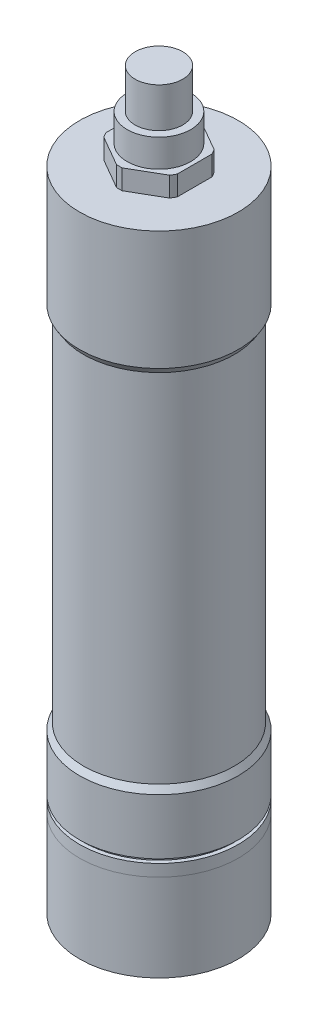
ISO-10303-21;
HEADER;
FILE_DESCRIPTION(('STEP AP214'),'2;1');
FILE_NAME('part.step','',(''),(''),'','','');
FILE_SCHEMA(('AUTOMOTIVE_DESIGN { 1 0 10303 214 1 1 1 1 }'));
ENDSEC;
DATA;
#1=APPLICATION_CONTEXT('core data for automotive mechanical design processes');
#2=APPLICATION_PROTOCOL_DEFINITION('international standard','automotive_design',2000,#1);
#3=PRODUCT_CONTEXT('',#1,'mechanical');
#4=PRODUCT('Part','Part','',(#3));
#5=PRODUCT_RELATED_PRODUCT_CATEGORY('part','',(#4));
#6=PRODUCT_DEFINITION_FORMATION('','',#4);
#7=PRODUCT_DEFINITION_CONTEXT('part definition',#1,'design');
#8=PRODUCT_DEFINITION('design','',#6,#7);
#9=PRODUCT_DEFINITION_SHAPE('','',#8);
#10=(LENGTH_UNIT() NAMED_UNIT(*) SI_UNIT(.MILLI.,.METRE.));
#11=(NAMED_UNIT(*) PLANE_ANGLE_UNIT() SI_UNIT($,.RADIAN.));
#12=(NAMED_UNIT(*) SI_UNIT($,.STERADIAN.) SOLID_ANGLE_UNIT());
#13=UNCERTAINTY_MEASURE_WITH_UNIT(LENGTH_MEASURE(1.E-05),#10,'distance_accuracy_value','');
#14=(GEOMETRIC_REPRESENTATION_CONTEXT(3) GLOBAL_UNCERTAINTY_ASSIGNED_CONTEXT((#13)) GLOBAL_UNIT_ASSIGNED_CONTEXT((#10,
#11,#12)) REPRESENTATION_CONTEXT('',''));
#15=CARTESIAN_POINT('',(0.,0.,0.));
#16=DIRECTION('',(0.,0.,1.));
#17=DIRECTION('',(1.,0.,0.));
#18=AXIS2_PLACEMENT_3D('',#15,#16,#17);
#19=CARTESIAN_POINT('',(-20.24,22.,20.24));
#20=DIRECTION('',(0.,-1.,0.));
#21=DIRECTION('',(0.,0.,-1.));
#22=AXIS2_PLACEMENT_3D('',#19,#20,#21);
#23=PLANE('',#22);
#24=CARTESIAN_POINT('',(0.,22.,0.));
#25=DIRECTION('',(0.,1.,0.));
#26=DIRECTION('',(0.,0.,1.));
#27=AXIS2_PLACEMENT_3D('',#24,#25,#26);
#28=CIRCLE('',#27,20.);
#29=CARTESIAN_POINT('',(0.,22.,20.));
#30=VERTEX_POINT('',#29);
#31=EDGE_CURVE('P0_E20',#30,#30,#28,.F.);
#32=ORIENTED_EDGE('',*,*,#31,.T.);
#33=EDGE_LOOP('',(#32));
#34=FACE_BOUND('',#33,.T.);
#35=ADVANCED_FACE('P0_F16',(#34),#23,.T.);
#36=CARTESIAN_POINT('',(0.,22.,0.));
#37=DIRECTION('',(0.,1.,0.));
#38=DIRECTION('',(0.,0.,1.));
#39=AXIS2_PLACEMENT_3D('',#36,#37,#38);
#40=CYLINDRICAL_SURFACE('',#39,20.);
#41=CARTESIAN_POINT('',(0.,25.,0.));
#42=DIRECTION('',(0.,1.,0.));
#43=DIRECTION('',(0.,0.,1.));
#44=AXIS2_PLACEMENT_3D('',#41,#42,#43);
#45=CIRCLE('',#44,20.);
#46=CARTESIAN_POINT('',(0.,25.,20.));
#47=VERTEX_POINT('',#46);
#48=EDGE_CURVE('P0_E249',#47,#47,#45,.F.);
#49=ORIENTED_EDGE('',*,*,#48,.T.);
#50=EDGE_LOOP('',(#49));
#51=FACE_BOUND('',#50,.T.);
#52=ORIENTED_EDGE('',*,*,#31,.F.);
#53=EDGE_LOOP('',(#52));
#54=FACE_BOUND('',#53,.T.);
#55=ADVANCED_FACE('P0_F260',(#51,#54),#40,.T.);
#56=CARTESIAN_POINT('',(-20.24,25.,-20.24));
#57=DIRECTION('',(0.,-1.,0.));
#58=DIRECTION('',(1.,0.,0.));
#59=AXIS2_PLACEMENT_3D('',#56,#57,#58);
#60=PLANE('',#59);
#61=CARTESIAN_POINT('',(0.,25.,0.));
#62=DIRECTION('',(0.,-1.,0.));
#63=DIRECTION('',(0.,0.,-1.));
#64=AXIS2_PLACEMENT_3D('',#61,#62,#63);
#65=CIRCLE('',#64,19.);
#66=CARTESIAN_POINT('',(0.,25.,-19.));
#67=VERTEX_POINT('',#66);
#68=EDGE_CURVE('P0_E246',#67,#67,#65,.T.);
#69=ORIENTED_EDGE('',*,*,#68,.T.);
#70=EDGE_LOOP('',(#69));
#71=FACE_BOUND('',#70,.T.);
#72=ORIENTED_EDGE('',*,*,#48,.F.);
#73=EDGE_LOOP('',(#72));
#74=FACE_BOUND('',#73,.T.);
#75=ADVANCED_FACE('P0_F262',(#71,#74),#60,.F.);
#76=CARTESIAN_POINT('',(0.,26.,0.));
#77=DIRECTION('',(0.,-1.,0.));
#78=DIRECTION('',(0.,0.,-1.));
#79=AXIS2_PLACEMENT_3D('',#76,#77,#78);
#80=CYLINDRICAL_SURFACE('',#79,19.);
#81=CARTESIAN_POINT('',(0.,26.,0.));
#82=DIRECTION('',(0.,-1.,0.));
#83=DIRECTION('',(0.,0.,-1.));
#84=AXIS2_PLACEMENT_3D('',#81,#82,#83);
#85=CIRCLE('',#84,19.);
#86=CARTESIAN_POINT('',(0.,26.,-19.));
#87=VERTEX_POINT('',#86);
#88=EDGE_CURVE('P0_E243',#87,#87,#85,.F.);
#89=ORIENTED_EDGE('',*,*,#88,.F.);
#90=EDGE_LOOP('',(#89));
#91=FACE_BOUND('',#90,.T.);
#92=ORIENTED_EDGE('',*,*,#68,.F.);
#93=EDGE_LOOP('',(#92));
#94=FACE_BOUND('',#93,.T.);
#95=ADVANCED_FACE('P0_F269',(#91,#94),#80,.T.);
#96=CARTESIAN_POINT('',(-20.24,26.,-20.24));
#97=DIRECTION('',(0.,-1.,0.));
#98=DIRECTION('',(1.,0.,0.));
#99=AXIS2_PLACEMENT_3D('',#96,#97,#98);
#100=PLANE('',#99);
#101=ORIENTED_EDGE('',*,*,#88,.T.);
#102=EDGE_LOOP('',(#101));
#103=FACE_BOUND('',#102,.T.);
#104=CARTESIAN_POINT('',(0.,26.,0.));
#105=DIRECTION('',(0.,1.,0.));
#106=DIRECTION('',(0.,0.,1.));
#107=AXIS2_PLACEMENT_3D('',#104,#105,#106);
#108=CIRCLE('',#107,20.);
#109=CARTESIAN_POINT('',(0.,26.,20.));
#110=VERTEX_POINT('',#109);
#111=EDGE_CURVE('P0_E187',#110,#110,#108,.F.);
#112=ORIENTED_EDGE('',*,*,#111,.T.);
#113=EDGE_LOOP('',(#112));
#114=FACE_BOUND('',#113,.T.);
#115=ADVANCED_FACE('P0_F326',(#103,#114),#100,.T.);
#116=CARTESIAN_POINT('',(0.,26.,0.));
#117=DIRECTION('',(0.,1.,0.));
#118=DIRECTION('',(0.,0.,1.));
#119=AXIS2_PLACEMENT_3D('',#116,#117,#118);
#120=CYLINDRICAL_SURFACE('',#119,20.);
#121=ORIENTED_EDGE('',*,*,#111,.F.);
#122=EDGE_LOOP('',(#121));
#123=FACE_BOUND('',#122,.T.);
#124=CARTESIAN_POINT('',(0.,40.,0.));
#125=DIRECTION('',(0.,-1.,0.));
#126=DIRECTION('',(1.,0.,0.));
#127=AXIS2_PLACEMENT_3D('',#124,#125,#126);
#128=CIRCLE('',#127,20.);
#129=CARTESIAN_POINT('',(20.,40.,0.));
#130=VERTEX_POINT('',#129);
#131=EDGE_CURVE('P0_E184',#130,#130,#128,.T.);
#132=ORIENTED_EDGE('',*,*,#131,.T.);
#133=EDGE_LOOP('',(#132));
#134=FACE_BOUND('',#133,.T.);
#135=ADVANCED_FACE('P0_F323',(#123,#134),#120,.T.);
#136=CARTESIAN_POINT('',(0.,41.6,0.));
#137=DIRECTION('',(0.,-1.,0.));
#138=DIRECTION('',(0.,0.,-1.));
#139=AXIS2_PLACEMENT_3D('',#136,#137,#138);
#140=CONICAL_SURFACE('',#139,19.,0.558599315343562);
#141=CARTESIAN_POINT('',(0.,41.6,0.));
#142=DIRECTION('',(0.,1.,0.));
#143=DIRECTION('',(-1.,0.,0.));
#144=AXIS2_PLACEMENT_3D('',#141,#142,#143);
#145=CIRCLE('',#144,19.);
#146=CARTESIAN_POINT('',(-19.,41.6,0.));
#147=VERTEX_POINT('',#146);
#148=EDGE_CURVE('P0_E180',#147,#147,#145,.F.);
#149=ORIENTED_EDGE('',*,*,#148,.T.);
#150=EDGE_LOOP('',(#149));
#151=FACE_BOUND('',#150,.T.);
#152=ORIENTED_EDGE('',*,*,#131,.F.);
#153=EDGE_LOOP('',(#152));
#154=FACE_BOUND('',#153,.T.);
#155=ADVANCED_FACE('P0_F319',(#151,#154),#140,.T.);
#156=CARTESIAN_POINT('',(0.,41.6,0.));
#157=DIRECTION('',(0.,1.,0.));
#158=DIRECTION('',(0.,0.,1.));
#159=AXIS2_PLACEMENT_3D('',#156,#157,#158);
#160=CYLINDRICAL_SURFACE('',#159,19.);
#161=ORIENTED_EDGE('',*,*,#148,.F.);
#162=EDGE_LOOP('',(#161));
#163=FACE_BOUND('',#162,.T.);
#164=CARTESIAN_POINT('',(0.,131.4,0.));
#165=DIRECTION('',(0.,1.,0.));
#166=DIRECTION('',(-1.,0.,0.));
#167=AXIS2_PLACEMENT_3D('',#164,#165,#166);
#168=CIRCLE('',#167,19.);
#169=CARTESIAN_POINT('',(-19.,131.4,0.));
#170=VERTEX_POINT('',#169);
#171=EDGE_CURVE('P0_E176',#170,#170,#168,.F.);
#172=ORIENTED_EDGE('',*,*,#171,.T.);
#173=EDGE_LOOP('',(#172));
#174=FACE_BOUND('',#173,.T.);
#175=ADVANCED_FACE('P0_F315',(#163,#174),#160,.T.);
#176=CARTESIAN_POINT('',(0.,131.4,0.));
#177=DIRECTION('',(0.,1.,0.));
#178=DIRECTION('',(0.,0.,1.));
#179=AXIS2_PLACEMENT_3D('',#176,#177,#178);
#180=CONICAL_SURFACE('',#179,19.,0.558599315343566);
#181=ORIENTED_EDGE('',*,*,#171,.F.);
#182=EDGE_LOOP('',(#181));
#183=FACE_BOUND('',#182,.T.);
#184=CARTESIAN_POINT('',(0.,133.,0.));
#185=DIRECTION('',(0.,1.,0.));
#186=DIRECTION('',(-1.,0.,0.));
#187=AXIS2_PLACEMENT_3D('',#184,#185,#186);
#188=CIRCLE('',#187,20.);
#189=CARTESIAN_POINT('',(-20.,133.,0.));
#190=VERTEX_POINT('',#189);
#191=EDGE_CURVE('P0_E172',#190,#190,#188,.F.);
#192=ORIENTED_EDGE('',*,*,#191,.T.);
#193=EDGE_LOOP('',(#192));
#194=FACE_BOUND('',#193,.T.);
#195=ADVANCED_FACE('P0_F311',(#183,#194),#180,.T.);
#196=CARTESIAN_POINT('',(0.,133.,0.));
#197=DIRECTION('',(0.,1.,0.));
#198=DIRECTION('',(0.,0.,1.));
#199=AXIS2_PLACEMENT_3D('',#196,#197,#198);
#200=CYLINDRICAL_SURFACE('',#199,20.);
#201=ORIENTED_EDGE('',*,*,#191,.F.);
#202=EDGE_LOOP('',(#201));
#203=FACE_BOUND('',#202,.T.);
#204=CARTESIAN_POINT('',(0.,163.,0.));
#205=DIRECTION('',(0.,1.,0.));
#206=DIRECTION('',(0.,0.,1.));
#207=AXIS2_PLACEMENT_3D('',#204,#205,#206);
#208=CIRCLE('',#207,20.);
#209=CARTESIAN_POINT('',(0.,163.,20.));
#210=VERTEX_POINT('',#209);
#211=EDGE_CURVE('P0_E125',#210,#210,#208,.T.);
#212=ORIENTED_EDGE('',*,*,#211,.F.);
#213=EDGE_LOOP('',(#212));
#214=FACE_BOUND('',#213,.T.);
#215=ADVANCED_FACE('P0_F308',(#203,#214),#200,.T.);
#216=CARTESIAN_POINT('',(0.,163.,0.));
#217=DIRECTION('',(0.,1.,0.));
#218=DIRECTION('',(0.,0.,1.));
#219=AXIS2_PLACEMENT_3D('',#216,#217,#218);
#220=CYLINDRICAL_SURFACE('',#219,10.);
#221=DIRECTION('',(0.,1.,0.));
#222=VECTOR('',#221,1.);
#223=CARTESIAN_POINT('',(-8.274917218,165.5,-5.614779162));
#224=LINE('',#223,#222);
#225=CARTESIAN_POINT('',(-8.27491721786181,163.,-5.61477916207979));
#226=VERTEX_POINT('',#225);
#227=CARTESIAN_POINT('',(-8.27491721517859,168.,-5.61477916603424));
#228=VERTEX_POINT('',#227);
#229=EDGE_CURVE('P0_E170',#226,#228,#224,.T.);
#230=ORIENTED_EDGE('',*,*,#229,.F.);
#231=CARTESIAN_POINT('',(0.,163.,0.));
#232=DIRECTION('',(0.,1.,0.));
#233=DIRECTION('',(0.,0.,1.));
#234=AXIS2_PLACEMENT_3D('',#231,#232,#233);
#235=CIRCLE('',#234,10.);
#236=CARTESIAN_POINT('',(-9.,163.,-4.35889894377034));
#237=VERTEX_POINT('',#236);
#238=EDGE_CURVE('P0_E213',#237,#226,#235,.F.);
#239=ORIENTED_EDGE('',*,*,#238,.F.);
#240=DIRECTION('',(0.,-1.,0.));
#241=VECTOR('',#240,1.);
#242=CARTESIAN_POINT('',(-9.,165.5,-4.358898944));
#243=LINE('',#242,#241);
#244=CARTESIAN_POINT('',(-9.,168.,-4.35889894377033));
#245=VERTEX_POINT('',#244);
#246=EDGE_CURVE('P0_E165',#245,#237,#243,.T.);
#247=ORIENTED_EDGE('',*,*,#246,.F.);
#248=CARTESIAN_POINT('',(0.,168.,0.));
#249=DIRECTION('',(0.,1.,0.));
#250=DIRECTION('',(0.,0.,1.));
#251=AXIS2_PLACEMENT_3D('',#248,#249,#250);
#252=CIRCLE('',#251,10.);
#253=EDGE_CURVE('P0_E65',#228,#245,#252,.T.);
#254=ORIENTED_EDGE('',*,*,#253,.F.);
#255=EDGE_LOOP('',(#230,#239,#247,#254));
#256=FACE_BOUND('',#255,.T.);
#257=ADVANCED_FACE('P0_F304',(#256),#220,.T.);
#258=CARTESIAN_POINT('',(0.,163.,0.));
#259=DIRECTION('',(0.,1.,0.));
#260=DIRECTION('',(0.,0.,1.));
#261=AXIS2_PLACEMENT_3D('',#258,#259,#260);
#262=CYLINDRICAL_SURFACE('',#261,10.);
#263=DIRECTION('',(0.,1.,0.));
#264=VECTOR('',#263,1.);
#265=CARTESIAN_POINT('',(-9.,165.5,4.358898944));
#266=LINE('',#265,#264);
#267=CARTESIAN_POINT('',(-9.,163.,4.35889894377034));
#268=VERTEX_POINT('',#267);
#269=CARTESIAN_POINT('',(-9.,168.,4.35889894377034));
#270=VERTEX_POINT('',#269);
#271=EDGE_CURVE('P0_E164',#268,#270,#266,.T.);
#272=ORIENTED_EDGE('',*,*,#271,.F.);
#273=CARTESIAN_POINT('',(0.,163.,0.));
#274=DIRECTION('',(0.,1.,0.));
#275=DIRECTION('',(0.,0.,1.));
#276=AXIS2_PLACEMENT_3D('',#273,#274,#275);
#277=CIRCLE('',#276,10.);
#278=CARTESIAN_POINT('',(-8.27491721786181,163.,5.61477916207979));
#279=VERTEX_POINT('',#278);
#280=EDGE_CURVE('P0_E216',#279,#268,#277,.F.);
#281=ORIENTED_EDGE('',*,*,#280,.F.);
#282=DIRECTION('',(0.,-1.,0.));
#283=VECTOR('',#282,1.);
#284=CARTESIAN_POINT('',(-8.274917218,165.5,5.614779162));
#285=LINE('',#284,#283);
#286=CARTESIAN_POINT('',(-8.27491721517859,168.,5.61477916603424));
#287=VERTEX_POINT('',#286);
#288=EDGE_CURVE('P0_E159',#287,#279,#285,.T.);
#289=ORIENTED_EDGE('',*,*,#288,.F.);
#290=CARTESIAN_POINT('',(0.,168.,0.));
#291=DIRECTION('',(0.,1.,0.));
#292=DIRECTION('',(0.,0.,1.));
#293=AXIS2_PLACEMENT_3D('',#290,#291,#292);
#294=CIRCLE('',#293,10.);
#295=EDGE_CURVE('P0_E235',#270,#287,#294,.T.);
#296=ORIENTED_EDGE('',*,*,#295,.F.);
#297=EDGE_LOOP('',(#272,#281,#289,#296));
#298=FACE_BOUND('',#297,.T.);
#299=ADVANCED_FACE('P0_F300',(#298),#262,.T.);
#300=CARTESIAN_POINT('',(0.,163.,0.));
#301=DIRECTION('',(0.,1.,0.));
#302=DIRECTION('',(0.,0.,1.));
#303=AXIS2_PLACEMENT_3D('',#300,#301,#302);
#304=CYLINDRICAL_SURFACE('',#303,10.);
#305=DIRECTION('',(0.,1.,0.));
#306=VECTOR('',#305,1.);
#307=CARTESIAN_POINT('',(-0.725082782,165.5,9.973678106));
#308=LINE('',#307,#306);
#309=CARTESIAN_POINT('',(-0.725082782141888,163.,9.97367810591808));
#310=VERTEX_POINT('',#309);
#311=CARTESIAN_POINT('',(-0.725082776186672,168.,9.97367810635103));
#312=VERTEX_POINT('',#311);
#313=EDGE_CURVE('P0_E158',#310,#312,#308,.T.);
#314=ORIENTED_EDGE('',*,*,#313,.F.);
#315=CARTESIAN_POINT('',(0.,163.,0.));
#316=DIRECTION('',(0.,1.,0.));
#317=DIRECTION('',(0.,0.,1.));
#318=AXIS2_PLACEMENT_3D('',#315,#316,#317);
#319=CIRCLE('',#318,10.);
#320=CARTESIAN_POINT('',(0.725082782141888,163.,9.97367810591808));
#321=VERTEX_POINT('',#320);
#322=EDGE_CURVE('P0_E219',#321,#310,#319,.F.);
#323=ORIENTED_EDGE('',*,*,#322,.F.);
#324=DIRECTION('',(0.,-1.,0.));
#325=VECTOR('',#324,1.);
#326=CARTESIAN_POINT('',(0.725082782,165.5,9.973678106));
#327=LINE('',#326,#325);
#328=CARTESIAN_POINT('',(0.725082776186675,168.,9.97367810635103));
#329=VERTEX_POINT('',#328);
#330=EDGE_CURVE('P0_E153',#329,#321,#327,.T.);
#331=ORIENTED_EDGE('',*,*,#330,.F.);
#332=CARTESIAN_POINT('',(0.,168.,0.));
#333=DIRECTION('',(0.,1.,0.));
#334=DIRECTION('',(0.,0.,1.));
#335=AXIS2_PLACEMENT_3D('',#332,#333,#334);
#336=CIRCLE('',#335,10.);
#337=EDGE_CURVE('P0_E232',#312,#329,#336,.T.);
#338=ORIENTED_EDGE('',*,*,#337,.F.);
#339=EDGE_LOOP('',(#314,#323,#331,#338));
#340=FACE_BOUND('',#339,.T.);
#341=ADVANCED_FACE('P0_F296',(#340),#304,.T.);
#342=CARTESIAN_POINT('',(0.,163.,0.));
#343=DIRECTION('',(0.,1.,0.));
#344=DIRECTION('',(0.,0.,1.));
#345=AXIS2_PLACEMENT_3D('',#342,#343,#344);
#346=CYLINDRICAL_SURFACE('',#345,10.);
#347=DIRECTION('',(0.,1.,0.));
#348=VECTOR('',#347,1.);
#349=CARTESIAN_POINT('',(8.274917218,165.5,5.614779162));
#350=LINE('',#349,#348);
#351=CARTESIAN_POINT('',(8.27491721786181,163.,5.61477916207979));
#352=VERTEX_POINT('',#351);
#353=CARTESIAN_POINT('',(8.27491721517859,168.,5.61477916603424));
#354=VERTEX_POINT('',#353);
#355=EDGE_CURVE('P0_E144',#352,#354,#350,.T.);
#356=ORIENTED_EDGE('',*,*,#355,.F.);
#357=CARTESIAN_POINT('',(0.,163.,0.));
#358=DIRECTION('',(0.,1.,0.));
#359=DIRECTION('',(0.,0.,1.));
#360=AXIS2_PLACEMENT_3D('',#357,#358,#359);
#361=CIRCLE('',#360,10.);
#362=CARTESIAN_POINT('',(9.,163.,4.35889894377034));
#363=VERTEX_POINT('',#362);
#364=EDGE_CURVE('P0_E124',#363,#352,#361,.F.);
#365=ORIENTED_EDGE('',*,*,#364,.F.);
#366=DIRECTION('',(0.,-1.,0.));
#367=VECTOR('',#366,1.);
#368=CARTESIAN_POINT('',(9.,165.5,4.358898944));
#369=LINE('',#368,#367);
#370=CARTESIAN_POINT('',(9.,168.,4.35889894377034));
#371=VERTEX_POINT('',#370);
#372=EDGE_CURVE('P0_E137',#371,#363,#369,.T.);
#373=ORIENTED_EDGE('',*,*,#372,.F.);
#374=CARTESIAN_POINT('',(0.,168.,0.));
#375=DIRECTION('',(0.,1.,0.));
#376=DIRECTION('',(0.,0.,1.));
#377=AXIS2_PLACEMENT_3D('',#374,#375,#376);
#378=CIRCLE('',#377,10.);
#379=EDGE_CURVE('P0_E229',#354,#371,#378,.T.);
#380=ORIENTED_EDGE('',*,*,#379,.F.);
#381=EDGE_LOOP('',(#356,#365,#373,#380));
#382=FACE_BOUND('',#381,.T.);
#383=ADVANCED_FACE('P0_F293',(#382),#346,.T.);
#384=CARTESIAN_POINT('',(0.,163.,0.));
#385=DIRECTION('',(0.,1.,0.));
#386=DIRECTION('',(0.,0.,1.));
#387=AXIS2_PLACEMENT_3D('',#384,#385,#386);
#388=CYLINDRICAL_SURFACE('',#387,10.);
#389=DIRECTION('',(0.,1.,0.));
#390=VECTOR('',#389,1.);
#391=CARTESIAN_POINT('',(9.,165.5,-4.358898944));
#392=LINE('',#391,#390);
#393=CARTESIAN_POINT('',(9.,163.,-4.35889894377034));
#394=VERTEX_POINT('',#393);
#395=CARTESIAN_POINT('',(9.,168.,-4.35889894377033));
#396=VERTEX_POINT('',#395);
#397=EDGE_CURVE('P0_E128',#394,#396,#392,.T.);
#398=ORIENTED_EDGE('',*,*,#397,.F.);
#399=CARTESIAN_POINT('',(0.,163.,0.));
#400=DIRECTION('',(0.,1.,0.));
#401=DIRECTION('',(0.,0.,1.));
#402=AXIS2_PLACEMENT_3D('',#399,#400,#401);
#403=CIRCLE('',#402,10.);
#404=CARTESIAN_POINT('',(8.27491721786181,163.,-5.61477916207979));
#405=VERTEX_POINT('',#404);
#406=EDGE_CURVE('P0_E110',#405,#394,#403,.F.);
#407=ORIENTED_EDGE('',*,*,#406,.F.);
#408=DIRECTION('',(0.,-1.,0.));
#409=VECTOR('',#408,1.);
#410=CARTESIAN_POINT('',(8.274917218,165.5,-5.614779162));
#411=LINE('',#410,#409);
#412=CARTESIAN_POINT('',(8.27491721517859,168.,-5.61477916603424));
#413=VERTEX_POINT('',#412);
#414=EDGE_CURVE('P0_E133',#413,#405,#411,.T.);
#415=ORIENTED_EDGE('',*,*,#414,.F.);
#416=CARTESIAN_POINT('',(0.,168.,0.));
#417=DIRECTION('',(0.,1.,0.));
#418=DIRECTION('',(0.,0.,1.));
#419=AXIS2_PLACEMENT_3D('',#416,#417,#418);
#420=CIRCLE('',#419,10.);
#421=EDGE_CURVE('P0_E36',#396,#413,#420,.T.);
#422=ORIENTED_EDGE('',*,*,#421,.F.);
#423=EDGE_LOOP('',(#398,#407,#415,#422));
#424=FACE_BOUND('',#423,.T.);
#425=ADVANCED_FACE('P0_F129',(#424),#388,.T.);
#426=CARTESIAN_POINT('',(20.24,163.,-20.24));
#427=DIRECTION('',(0.,1.,0.));
#428=DIRECTION('',(-1.,0.,0.));
#429=AXIS2_PLACEMENT_3D('',#426,#427,#428);
#430=PLANE('',#429);
#431=DIRECTION('',(0.,0.,1.));
#432=VECTOR('',#431,1.);
#433=CARTESIAN_POINT('',(-9.,163.,0.));
#434=LINE('',#433,#432);
#435=EDGE_CURVE('P0_E160',#237,#268,#434,.T.);
#436=ORIENTED_EDGE('',*,*,#435,.F.);
#437=ORIENTED_EDGE('',*,*,#238,.T.);
#438=DIRECTION('',(-0.866025403782537,0.,0.500000000003294));
#439=VECTOR('',#438,1.);
#440=CARTESIAN_POINT('',(-4.5,163.,-7.794228634));
#441=LINE('',#440,#439);
#442=CARTESIAN_POINT('',(-0.725082782141888,163.,-9.97367810591808));
#443=VERTEX_POINT('',#442);
#444=EDGE_CURVE('P0_E166',#443,#226,#441,.T.);
#445=ORIENTED_EDGE('',*,*,#444,.F.);
#446=CARTESIAN_POINT('',(0.,163.,0.));
#447=DIRECTION('',(0.,1.,0.));
#448=DIRECTION('',(0.,0.,1.));
#449=AXIS2_PLACEMENT_3D('',#446,#447,#448);
#450=CIRCLE('',#449,10.);
#451=CARTESIAN_POINT('',(0.725082782141888,163.,-9.97367810591808));
#452=VERTEX_POINT('',#451);
#453=EDGE_CURVE('P0_E208',#443,#452,#450,.F.);
#454=ORIENTED_EDGE('',*,*,#453,.T.);
#455=DIRECTION('',(-0.866025403782537,0.,-0.500000000003294));
#456=VECTOR('',#455,1.);
#457=CARTESIAN_POINT('',(4.5,163.,-7.794228634));
#458=LINE('',#457,#456);
#459=EDGE_CURVE('P0_E120',#405,#452,#458,.T.);
#460=ORIENTED_EDGE('',*,*,#459,.F.);
#461=ORIENTED_EDGE('',*,*,#406,.T.);
#462=DIRECTION('',(0.,0.,-1.));
#463=VECTOR('',#462,1.);
#464=CARTESIAN_POINT('',(9.,163.,0.));
#465=LINE('',#464,#463);
#466=EDGE_CURVE('P0_E116',#363,#394,#465,.T.);
#467=ORIENTED_EDGE('',*,*,#466,.F.);
#468=ORIENTED_EDGE('',*,*,#364,.T.);
#469=DIRECTION('',(0.866025403782537,0.,-0.500000000003294));
#470=VECTOR('',#469,1.);
#471=CARTESIAN_POINT('',(4.5,163.,7.794228634));
#472=LINE('',#471,#470);
#473=EDGE_CURVE('P0_E149',#321,#352,#472,.T.);
#474=ORIENTED_EDGE('',*,*,#473,.F.);
#475=ORIENTED_EDGE('',*,*,#322,.T.);
#476=DIRECTION('',(0.866025403782537,0.,0.500000000003294));
#477=VECTOR('',#476,1.);
#478=CARTESIAN_POINT('',(-4.5,163.,7.794228634));
#479=LINE('',#478,#477);
#480=EDGE_CURVE('P0_E154',#279,#310,#479,.T.);
#481=ORIENTED_EDGE('',*,*,#480,.F.);
#482=ORIENTED_EDGE('',*,*,#280,.T.);
#483=EDGE_LOOP('',(#436,#437,#445,#454,#460,#461,#467,#468,#474,#475,#481,#482));
#484=FACE_BOUND('',#483,.T.);
#485=ORIENTED_EDGE('',*,*,#211,.T.);
#486=EDGE_LOOP('',(#485));
#487=FACE_BOUND('',#486,.T.);
#488=ADVANCED_FACE('P0_F113',(#484,#487),#430,.T.);
#489=CARTESIAN_POINT('',(0.,163.,0.));
#490=DIRECTION('',(0.,1.,0.));
#491=DIRECTION('',(0.,0.,1.));
#492=AXIS2_PLACEMENT_3D('',#489,#490,#491);
#493=CYLINDRICAL_SURFACE('',#492,10.);
#494=DIRECTION('',(0.,-1.,0.));
#495=VECTOR('',#494,1.);
#496=CARTESIAN_POINT('',(-0.725082782,165.5,-9.973678106));
#497=LINE('',#496,#495);
#498=CARTESIAN_POINT('',(-0.725082776186683,168.,-9.97367810635102));
#499=VERTEX_POINT('',#498);
#500=EDGE_CURVE('P0_E171',#499,#443,#497,.T.);
#501=ORIENTED_EDGE('',*,*,#500,.F.);
#502=CARTESIAN_POINT('',(0.,168.,0.));
#503=DIRECTION('',(0.,1.,0.));
#504=DIRECTION('',(0.,0.,1.));
#505=AXIS2_PLACEMENT_3D('',#502,#503,#504);
#506=CIRCLE('',#505,10.);
#507=CARTESIAN_POINT('',(0.725082776186683,168.,-9.97367810635102));
#508=VERTEX_POINT('',#507);
#509=EDGE_CURVE('P0_E72',#508,#499,#506,.T.);
#510=ORIENTED_EDGE('',*,*,#509,.F.);
#511=DIRECTION('',(0.,1.,0.));
#512=VECTOR('',#511,1.);
#513=CARTESIAN_POINT('',(0.725082782,165.5,-9.973678106));
#514=LINE('',#513,#512);
#515=EDGE_CURVE('P0_E207',#452,#508,#514,.T.);
#516=ORIENTED_EDGE('',*,*,#515,.F.);
#517=ORIENTED_EDGE('',*,*,#453,.F.);
#518=EDGE_LOOP('',(#501,#510,#516,#517));
#519=FACE_BOUND('',#518,.T.);
#520=ADVANCED_FACE('P0_F286',(#519),#493,.T.);
#521=CARTESIAN_POINT('',(-0.725082782,163.,-9.973678106));
#522=DIRECTION('',(-0.500000000003294,0.,-0.866025403782537));
#523=DIRECTION('',(-0.866025403782537,0.,0.500000000003294));
#524=AXIS2_PLACEMENT_3D('',#521,#522,#523);
#525=PLANE('',#524);
#526=ORIENTED_EDGE('',*,*,#444,.T.);
#527=ORIENTED_EDGE('',*,*,#229,.T.);
#528=DIRECTION('',(-0.866025404320025,0.,0.499999999072337));
#529=VECTOR('',#528,1.);
#530=CARTESIAN_POINT('',(-0.725082785999998,168.,-9.97367809768));
#531=LINE('',#530,#529);
#532=EDGE_CURVE('P0_E205',#499,#228,#531,.T.);
#533=ORIENTED_EDGE('',*,*,#532,.F.);
#534=ORIENTED_EDGE('',*,*,#500,.T.);
#535=EDGE_LOOP('',(#526,#527,#533,#534));
#536=FACE_BOUND('',#535,.T.);
#537=ADVANCED_FACE('P0_F289',(#536),#525,.T.);
#538=CARTESIAN_POINT('',(-9.,168.,-4.358898944));
#539=DIRECTION('',(-1.,0.,0.));
#540=DIRECTION('',(0.,-1.,0.));
#541=AXIS2_PLACEMENT_3D('',#538,#539,#540);
#542=PLANE('',#541);
#543=ORIENTED_EDGE('',*,*,#435,.T.);
#544=ORIENTED_EDGE('',*,*,#271,.T.);
#545=DIRECTION('',(0.,0.,1.));
#546=VECTOR('',#545,1.);
#547=CARTESIAN_POINT('',(-9.,168.,0.));
#548=LINE('',#547,#546);
#549=EDGE_CURVE('P0_E204',#245,#270,#548,.T.);
#550=ORIENTED_EDGE('',*,*,#549,.F.);
#551=ORIENTED_EDGE('',*,*,#246,.T.);
#552=EDGE_LOOP('',(#543,#544,#550,#551));
#553=FACE_BOUND('',#552,.T.);
#554=ADVANCED_FACE('P0_F351',(#553),#542,.T.);
#555=CARTESIAN_POINT('',(-8.274917218,163.,5.614779162));
#556=DIRECTION('',(-0.500000000003294,0.,0.866025403782537));
#557=DIRECTION('',(0.866025403782537,0.,0.500000000003294));
#558=AXIS2_PLACEMENT_3D('',#555,#556,#557);
#559=PLANE('',#558);
#560=ORIENTED_EDGE('',*,*,#480,.T.);
#561=ORIENTED_EDGE('',*,*,#313,.T.);
#562=DIRECTION('',(0.866025404320025,0.,0.499999999072337));
#563=VECTOR('',#562,1.);
#564=CARTESIAN_POINT('',(-8.274917214,168.,5.61477916912));
#565=LINE('',#564,#563);
#566=EDGE_CURVE('P0_E200',#287,#312,#565,.T.);
#567=ORIENTED_EDGE('',*,*,#566,.F.);
#568=ORIENTED_EDGE('',*,*,#288,.T.);
#569=EDGE_LOOP('',(#560,#561,#567,#568));
#570=FACE_BOUND('',#569,.T.);
#571=ADVANCED_FACE('P0_F355',(#570),#559,.T.);
#572=CARTESIAN_POINT('',(0.725082782,163.,9.973678106));
#573=DIRECTION('',(0.500000000003294,0.,0.866025403782537));
#574=DIRECTION('',(0.866025403782537,0.,-0.500000000003294));
#575=AXIS2_PLACEMENT_3D('',#572,#573,#574);
#576=PLANE('',#575);
#577=ORIENTED_EDGE('',*,*,#473,.T.);
#578=ORIENTED_EDGE('',*,*,#355,.T.);
#579=DIRECTION('',(0.866025404320025,0.,-0.499999999072337));
#580=VECTOR('',#579,1.);
#581=CARTESIAN_POINT('',(0.725082786,168.,9.97367809768));
#582=LINE('',#581,#580);
#583=EDGE_CURVE('P0_E196',#329,#354,#582,.T.);
#584=ORIENTED_EDGE('',*,*,#583,.F.);
#585=ORIENTED_EDGE('',*,*,#330,.T.);
#586=EDGE_LOOP('',(#577,#578,#584,#585));
#587=FACE_BOUND('',#586,.T.);
#588=ADVANCED_FACE('P0_F359',(#587),#576,.T.);
#589=CARTESIAN_POINT('',(9.,163.,4.358898944));
#590=DIRECTION('',(1.,0.,0.));
#591=DIRECTION('',(0.,0.,-1.));
#592=AXIS2_PLACEMENT_3D('',#589,#590,#591);
#593=PLANE('',#592);
#594=ORIENTED_EDGE('',*,*,#466,.T.);
#595=ORIENTED_EDGE('',*,*,#397,.T.);
#596=DIRECTION('',(0.,0.,-1.));
#597=VECTOR('',#596,1.);
#598=CARTESIAN_POINT('',(9.,168.,0.));
#599=LINE('',#598,#597);
#600=EDGE_CURVE('P0_E195',#371,#396,#599,.T.);
#601=ORIENTED_EDGE('',*,*,#600,.F.);
#602=ORIENTED_EDGE('',*,*,#372,.T.);
#603=EDGE_LOOP('',(#594,#595,#601,#602));
#604=FACE_BOUND('',#603,.T.);
#605=ADVANCED_FACE('P0_F135',(#604),#593,.T.);
#606=CARTESIAN_POINT('',(8.274917218,163.,-5.614779162));
#607=DIRECTION('',(0.500000000003294,0.,-0.866025403782537));
#608=DIRECTION('',(-0.866025403782537,0.,-0.500000000003294));
#609=AXIS2_PLACEMENT_3D('',#606,#607,#608);
#610=PLANE('',#609);
#611=ORIENTED_EDGE('',*,*,#459,.T.);
#612=ORIENTED_EDGE('',*,*,#515,.T.);
#613=DIRECTION('',(-0.866025404320025,0.,-0.499999999072337));
#614=VECTOR('',#613,1.);
#615=CARTESIAN_POINT('',(8.274917214,168.,-5.61477916912));
#616=LINE('',#615,#614);
#617=EDGE_CURVE('P0_E192',#413,#508,#616,.T.);
#618=ORIENTED_EDGE('',*,*,#617,.F.);
#619=ORIENTED_EDGE('',*,*,#414,.T.);
#620=EDGE_LOOP('',(#611,#612,#618,#619));
#621=FACE_BOUND('',#620,.T.);
#622=ADVANCED_FACE('P0_F366',(#621),#610,.T.);
#623=CARTESIAN_POINT('',(8.096,175.,-8.096));
#624=DIRECTION('',(0.,1.,0.));
#625=DIRECTION('',(-1.,0.,0.));
#626=AXIS2_PLACEMENT_3D('',#623,#624,#625);
#627=PLANE('',#626);
#628=CARTESIAN_POINT('',(0.,175.,0.));
#629=DIRECTION('',(0.,1.,0.));
#630=DIRECTION('',(0.,0.,1.));
#631=AXIS2_PLACEMENT_3D('',#628,#629,#630);
#632=CIRCLE('',#631,8.);
#633=CARTESIAN_POINT('',(0.,175.,8.));
#634=VERTEX_POINT('',#633);
#635=EDGE_CURVE('P0_E27',#634,#634,#632,.T.);
#636=ORIENTED_EDGE('',*,*,#635,.T.);
#637=EDGE_LOOP('',(#636));
#638=FACE_BOUND('',#637,.T.);
#639=ADVANCED_FACE('P0_F281',(#638),#627,.T.);
#640=CARTESIAN_POINT('',(9.,168.,-10.12));
#641=DIRECTION('',(0.,1.,0.));
#642=DIRECTION('',(-1.,0.,0.));
#643=AXIS2_PLACEMENT_3D('',#640,#641,#642);
#644=PLANE('',#643);
#645=CARTESIAN_POINT('',(0.,168.,0.));
#646=DIRECTION('',(0.,1.,0.));
#647=DIRECTION('',(0.,0.,1.));
#648=AXIS2_PLACEMENT_3D('',#645,#646,#647);
#649=CIRCLE('',#648,8.);
#650=CARTESIAN_POINT('',(0.,168.,8.));
#651=VERTEX_POINT('',#650);
#652=EDGE_CURVE('P0_E11',#651,#651,#649,.F.);
#653=ORIENTED_EDGE('',*,*,#652,.T.);
#654=EDGE_LOOP('',(#653));
#655=FACE_BOUND('',#654,.T.);
#656=ORIENTED_EDGE('',*,*,#421,.T.);
#657=ORIENTED_EDGE('',*,*,#617,.T.);
#658=ORIENTED_EDGE('',*,*,#509,.T.);
#659=ORIENTED_EDGE('',*,*,#532,.T.);
#660=ORIENTED_EDGE('',*,*,#253,.T.);
#661=ORIENTED_EDGE('',*,*,#549,.T.);
#662=ORIENTED_EDGE('',*,*,#295,.T.);
#663=ORIENTED_EDGE('',*,*,#566,.T.);
#664=ORIENTED_EDGE('',*,*,#337,.T.);
#665=ORIENTED_EDGE('',*,*,#583,.T.);
#666=ORIENTED_EDGE('',*,*,#379,.T.);
#667=ORIENTED_EDGE('',*,*,#600,.T.);
#668=EDGE_LOOP('',(#656,#657,#658,#659,#660,#661,#662,#663,#664,#665,#666,#667));
#669=FACE_BOUND('',#668,.T.);
#670=ADVANCED_FACE('P0_F18',(#655,#669),#644,.T.);
#671=CARTESIAN_POINT('',(0.,168.,0.));
#672=DIRECTION('',(0.,1.,0.));
#673=DIRECTION('',(0.,0.,1.));
#674=AXIS2_PLACEMENT_3D('',#671,#672,#673);
#675=CYLINDRICAL_SURFACE('',#674,8.);
#676=ORIENTED_EDGE('',*,*,#635,.F.);
#677=EDGE_LOOP('',(#676));
#678=FACE_BOUND('',#677,.T.);
#679=ORIENTED_EDGE('',*,*,#652,.F.);
#680=EDGE_LOOP('',(#679));
#681=FACE_BOUND('',#680,.T.);
#682=ADVANCED_FACE('P0_F274',(#678,#681),#675,.T.);
#683=CLOSED_SHELL('',(#35,#55,#75,#95,#115,#135,#155,#175,#195,#215,#257,#299,#341,#383,#425,
#488,#520,#537,#554,#571,#588,#605,#622,#639,#670,#682));
#684=MANIFOLD_SOLID_BREP('P0_B1',#683);
#685=CARTESIAN_POINT('',(-20.24,22.,20.24));
#686=DIRECTION('',(0.,-1.,0.));
#687=DIRECTION('',(0.,0.,-1.));
#688=AXIS2_PLACEMENT_3D('',#685,#686,#687);
#689=PLANE('',#688);
#690=CARTESIAN_POINT('',(0.,22.,0.));
#691=DIRECTION('',(0.,1.,0.));
#692=DIRECTION('',(0.,0.,1.));
#693=AXIS2_PLACEMENT_3D('',#690,#691,#692);
#694=CIRCLE('',#693,20.);
#695=CARTESIAN_POINT('',(0.,22.,20.));
#696=VERTEX_POINT('',#695);
#697=EDGE_CURVE('P1_E18',#696,#696,#694,.T.);
#698=ORIENTED_EDGE('',*,*,#697,.T.);
#699=EDGE_LOOP('',(#698));
#700=FACE_BOUND('',#699,.T.);
#701=ADVANCED_FACE('P1_F14',(#700),#689,.F.);
#702=CARTESIAN_POINT('',(-20.24,0.,-20.24));
#703=DIRECTION('',(0.,-1.,0.));
#704=DIRECTION('',(1.,0.,0.));
#705=AXIS2_PLACEMENT_3D('',#702,#703,#704);
#706=PLANE('',#705);
#707=CARTESIAN_POINT('',(0.,0.,0.));
#708=DIRECTION('',(0.,1.,0.));
#709=DIRECTION('',(0.,0.,1.));
#710=AXIS2_PLACEMENT_3D('',#707,#708,#709);
#711=CIRCLE('',#710,20.);
#712=CARTESIAN_POINT('',(0.,0.,20.));
#713=VERTEX_POINT('',#712);
#714=EDGE_CURVE('P1_E10',#713,#713,#711,.F.);
#715=ORIENTED_EDGE('',*,*,#714,.T.);
#716=EDGE_LOOP('',(#715));
#717=FACE_BOUND('',#716,.T.);
#718=ADVANCED_FACE('P1_F16',(#717),#706,.T.);
#719=CARTESIAN_POINT('',(0.,0.,0.));
#720=DIRECTION('',(0.,1.,0.));
#721=DIRECTION('',(0.,0.,1.));
#722=AXIS2_PLACEMENT_3D('',#719,#720,#721);
#723=CYLINDRICAL_SURFACE('',#722,20.);
#724=ORIENTED_EDGE('',*,*,#697,.F.);
#725=EDGE_LOOP('',(#724));
#726=FACE_BOUND('',#725,.T.);
#727=ORIENTED_EDGE('',*,*,#714,.F.);
#728=EDGE_LOOP('',(#727));
#729=FACE_BOUND('',#728,.T.);
#730=ADVANCED_FACE('P1_F31',(#726,#729),#723,.T.);
#731=CLOSED_SHELL('',(#701,#718,#730));
#732=MANIFOLD_SOLID_BREP('P1_B1',#731);
#733=CARTESIAN_POINT('',(6.072,185.,-6.072));
#734=DIRECTION('',(0.,1.,0.));
#735=DIRECTION('',(-1.,0.,0.));
#736=AXIS2_PLACEMENT_3D('',#733,#734,#735);
#737=PLANE('',#736);
#738=CARTESIAN_POINT('',(0.,185.,0.));
#739=DIRECTION('',(0.,1.,0.));
#740=DIRECTION('',(0.,0.,1.));
#741=AXIS2_PLACEMENT_3D('',#738,#739,#740);
#742=CIRCLE('',#741,6.);
#743=CARTESIAN_POINT('',(0.,185.,6.00000000000002));
#744=VERTEX_POINT('',#743);
#745=EDGE_CURVE('P2_E18',#744,#744,#742,.T.);
#746=ORIENTED_EDGE('',*,*,#745,.T.);
#747=EDGE_LOOP('',(#746));
#748=FACE_BOUND('',#747,.T.);
#749=ADVANCED_FACE('P2_F14',(#748),#737,.T.);
#750=CARTESIAN_POINT('',(6.072,175.,-6.072));
#751=DIRECTION('',(0.,1.,0.));
#752=DIRECTION('',(-1.,0.,0.));
#753=AXIS2_PLACEMENT_3D('',#750,#751,#752);
#754=PLANE('',#753);
#755=CARTESIAN_POINT('',(0.,175.,0.));
#756=DIRECTION('',(0.,1.,0.));
#757=DIRECTION('',(0.,0.,1.));
#758=AXIS2_PLACEMENT_3D('',#755,#756,#757);
#759=CIRCLE('',#758,6.);
#760=CARTESIAN_POINT('',(0.,175.,6.));
#761=VERTEX_POINT('',#760);
#762=EDGE_CURVE('P2_E10',#761,#761,#759,.F.);
#763=ORIENTED_EDGE('',*,*,#762,.T.);
#764=EDGE_LOOP('',(#763));
#765=FACE_BOUND('',#764,.T.);
#766=ADVANCED_FACE('P2_F16',(#765),#754,.F.);
#767=CARTESIAN_POINT('',(0.,175.,0.));
#768=DIRECTION('',(0.,1.,0.));
#769=DIRECTION('',(0.,0.,1.));
#770=AXIS2_PLACEMENT_3D('',#767,#768,#769);
#771=CYLINDRICAL_SURFACE('',#770,6.);
#772=ORIENTED_EDGE('',*,*,#745,.F.);
#773=EDGE_LOOP('',(#772));
#774=FACE_BOUND('',#773,.T.);
#775=ORIENTED_EDGE('',*,*,#762,.F.);
#776=EDGE_LOOP('',(#775));
#777=FACE_BOUND('',#776,.T.);
#778=ADVANCED_FACE('P2_F31',(#774,#777),#771,.T.);
#779=CLOSED_SHELL('',(#749,#766,#778));
#780=MANIFOLD_SOLID_BREP('P2_B1',#779);
#781=ADVANCED_BREP_SHAPE_REPRESENTATION('',(#18,#684,#732,#780),#14);
#782=SHAPE_DEFINITION_REPRESENTATION(#9,#781);
ENDSEC;
END-ISO-10303-21;
